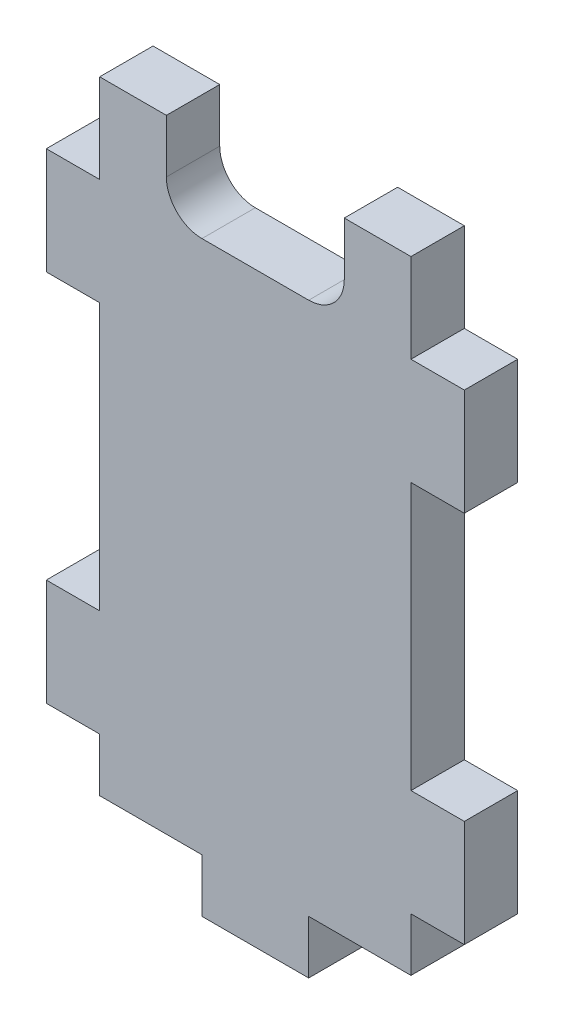
ISO-10303-21;
HEADER;
FILE_DESCRIPTION(('STEP AP214'),'2;1');
FILE_NAME('part.step','',(''),(''),'','','');
FILE_SCHEMA(('AUTOMOTIVE_DESIGN { 1 0 10303 214 1 1 1 1 }'));
ENDSEC;
DATA;
#1=APPLICATION_CONTEXT('core data for automotive mechanical design processes');
#2=APPLICATION_PROTOCOL_DEFINITION('international standard','automotive_design',2000,#1);
#3=PRODUCT_CONTEXT('',#1,'mechanical');
#4=PRODUCT('Part','Part','',(#3));
#5=PRODUCT_RELATED_PRODUCT_CATEGORY('part','',(#4));
#6=PRODUCT_DEFINITION_FORMATION('','',#4);
#7=PRODUCT_DEFINITION_CONTEXT('part definition',#1,'design');
#8=PRODUCT_DEFINITION('design','',#6,#7);
#9=PRODUCT_DEFINITION_SHAPE('','',#8);
#10=(LENGTH_UNIT() NAMED_UNIT(*) SI_UNIT(.MILLI.,.METRE.));
#11=(NAMED_UNIT(*) PLANE_ANGLE_UNIT() SI_UNIT($,.RADIAN.));
#12=(NAMED_UNIT(*) SI_UNIT($,.STERADIAN.) SOLID_ANGLE_UNIT());
#13=UNCERTAINTY_MEASURE_WITH_UNIT(LENGTH_MEASURE(1.E-05),#10,'distance_accuracy_value','');
#14=(GEOMETRIC_REPRESENTATION_CONTEXT(3) GLOBAL_UNCERTAINTY_ASSIGNED_CONTEXT((#13)) GLOBAL_UNIT_ASSIGNED_CONTEXT((#10,
#11,#12)) REPRESENTATION_CONTEXT('',''));
#15=CARTESIAN_POINT('',(0.,0.,0.));
#16=DIRECTION('',(0.,0.,1.));
#17=DIRECTION('',(1.,0.,0.));
#18=AXIS2_PLACEMENT_3D('',#15,#16,#17);
#19=CARTESIAN_POINT('',(-17.5,0.,-6.));
#20=DIRECTION('',(1.,0.,0.));
#21=DIRECTION('',(0.,0.,-1.));
#22=AXIS2_PLACEMENT_3D('',#19,#20,#21);
#23=PLANE('',#22);
#24=DIRECTION('',(0.,0.,1.));
#25=VECTOR('',#24,1.);
#26=CARTESIAN_POINT('',(-17.5,-29.,-19.4164078649987));
#27=LINE('',#26,#25);
#28=CARTESIAN_POINT('',(-17.5,-29.,-6.));
#29=VERTEX_POINT('',#28);
#30=CARTESIAN_POINT('',(-17.5,-29.,0.));
#31=VERTEX_POINT('',#30);
#32=EDGE_CURVE('E249',#29,#31,#27,.T.);
#33=ORIENTED_EDGE('',*,*,#32,.F.);
#34=DIRECTION('',(0.,1.,0.));
#35=VECTOR('',#34,1.);
#36=CARTESIAN_POINT('',(-17.5,0.,-6.));
#37=LINE('',#36,#35);
#38=CARTESIAN_POINT('',(-17.5,-35.,-6.));
#39=VERTEX_POINT('',#38);
#40=EDGE_CURVE('E381',#39,#29,#37,.T.);
#41=ORIENTED_EDGE('',*,*,#40,.F.);
#42=DIRECTION('',(0.,0.,1.));
#43=VECTOR('',#42,1.);
#44=CARTESIAN_POINT('',(-17.5,-35.,-6.));
#45=LINE('',#44,#43);
#46=CARTESIAN_POINT('',(-17.5,-35.,0.));
#47=VERTEX_POINT('',#46);
#48=EDGE_CURVE('E426',#39,#47,#45,.T.);
#49=ORIENTED_EDGE('',*,*,#48,.T.);
#50=DIRECTION('',(0.,1.,0.));
#51=VECTOR('',#50,1.);
#52=CARTESIAN_POINT('',(-17.5,0.,0.));
#53=LINE('',#52,#51);
#54=EDGE_CURVE('E414',#47,#31,#53,.T.);
#55=ORIENTED_EDGE('',*,*,#54,.T.);
#56=EDGE_LOOP('',(#33,#41,#49,#55));
#57=FACE_BOUND('',#56,.T.);
#58=ADVANCED_FACE('F41',(#57),#23,.F.);
#59=CARTESIAN_POINT('',(-17.5,-17.,-6.));
#60=VERTEX_POINT('',#59);
#61=CARTESIAN_POINT('',(-17.5,13.,-6.));
#62=VERTEX_POINT('',#61);
#63=EDGE_CURVE('E384',#60,#62,#37,.T.);
#64=ORIENTED_EDGE('',*,*,#63,.F.);
#65=DIRECTION('',(0.,0.,1.));
#66=VECTOR('',#65,1.);
#67=CARTESIAN_POINT('',(-17.5,-17.,-19.4164078649987));
#68=LINE('',#67,#66);
#69=CARTESIAN_POINT('',(-17.5,-17.,0.));
#70=VERTEX_POINT('',#69);
#71=EDGE_CURVE('E270',#60,#70,#68,.T.);
#72=ORIENTED_EDGE('',*,*,#71,.T.);
#73=CARTESIAN_POINT('',(-17.5,13.,0.));
#74=VERTEX_POINT('',#73);
#75=EDGE_CURVE('E416',#70,#74,#53,.T.);
#76=ORIENTED_EDGE('',*,*,#75,.T.);
#77=DIRECTION('',(0.,0.,1.));
#78=VECTOR('',#77,1.);
#79=CARTESIAN_POINT('',(-17.5,13.,-19.4164078649987));
#80=LINE('',#79,#78);
#81=EDGE_CURVE('E297',#62,#74,#80,.T.);
#82=ORIENTED_EDGE('',*,*,#81,.F.);
#83=EDGE_LOOP('',(#64,#72,#76,#82));
#84=FACE_BOUND('',#83,.T.);
#85=ADVANCED_FACE('F507',(#84),#23,.F.);
#86=CARTESIAN_POINT('',(17.5,0.,-6.));
#87=DIRECTION('',(1.,0.,0.));
#88=DIRECTION('',(0.,1.,0.));
#89=AXIS2_PLACEMENT_3D('',#86,#87,#88);
#90=PLANE('',#89);
#91=DIRECTION('',(0.,1.,0.));
#92=VECTOR('',#91,1.);
#93=CARTESIAN_POINT('',(17.5,0.,0.));
#94=LINE('',#93,#92);
#95=CARTESIAN_POINT('',(17.5,-17.,0.));
#96=VERTEX_POINT('',#95);
#97=CARTESIAN_POINT('',(17.5,13.,0.));
#98=VERTEX_POINT('',#97);
#99=EDGE_CURVE('E402',#96,#98,#94,.T.);
#100=ORIENTED_EDGE('',*,*,#99,.F.);
#101=DIRECTION('',(0.,0.,1.));
#102=VECTOR('',#101,1.);
#103=CARTESIAN_POINT('',(17.5,-17.,-19.4164078649987));
#104=LINE('',#103,#102);
#105=CARTESIAN_POINT('',(17.5,-17.,-6.));
#106=VERTEX_POINT('',#105);
#107=EDGE_CURVE('E324',#106,#96,#104,.T.);
#108=ORIENTED_EDGE('',*,*,#107,.F.);
#109=DIRECTION('',(0.,1.,0.));
#110=VECTOR('',#109,1.);
#111=CARTESIAN_POINT('',(17.5,0.,-6.));
#112=LINE('',#111,#110);
#113=CARTESIAN_POINT('',(17.5,13.,-6.));
#114=VERTEX_POINT('',#113);
#115=EDGE_CURVE('E370',#106,#114,#112,.T.);
#116=ORIENTED_EDGE('',*,*,#115,.T.);
#117=DIRECTION('',(0.,0.,1.));
#118=VECTOR('',#117,1.);
#119=CARTESIAN_POINT('',(17.5,13.,-19.4164078649987));
#120=LINE('',#119,#118);
#121=EDGE_CURVE('E348',#114,#98,#120,.T.);
#122=ORIENTED_EDGE('',*,*,#121,.T.);
#123=EDGE_LOOP('',(#100,#108,#116,#122));
#124=FACE_BOUND('',#123,.T.);
#125=ADVANCED_FACE('F478',(#124),#90,.T.);
#126=DIRECTION('',(0.,0.,1.));
#127=VECTOR('',#126,1.);
#128=CARTESIAN_POINT('',(17.5,-29.,-19.4164078649987));
#129=LINE('',#128,#127);
#130=CARTESIAN_POINT('',(17.5,-29.,-6.));
#131=VERTEX_POINT('',#130);
#132=CARTESIAN_POINT('',(17.5,-29.,0.));
#133=VERTEX_POINT('',#132);
#134=EDGE_CURVE('E321',#131,#133,#129,.T.);
#135=ORIENTED_EDGE('',*,*,#134,.T.);
#136=CARTESIAN_POINT('',(17.5,-35.,0.));
#137=VERTEX_POINT('',#136);
#138=EDGE_CURVE('E398',#137,#133,#94,.T.);
#139=ORIENTED_EDGE('',*,*,#138,.F.);
#140=DIRECTION('',(0.,0.,1.));
#141=VECTOR('',#140,1.);
#142=CARTESIAN_POINT('',(17.5,-35.,-6.));
#143=LINE('',#142,#141);
#144=CARTESIAN_POINT('',(17.5,-35.,-6.));
#145=VERTEX_POINT('',#144);
#146=EDGE_CURVE('E439',#145,#137,#143,.T.);
#147=ORIENTED_EDGE('',*,*,#146,.F.);
#148=EDGE_CURVE('E366',#145,#131,#112,.T.);
#149=ORIENTED_EDGE('',*,*,#148,.T.);
#150=EDGE_LOOP('',(#135,#139,#147,#149));
#151=FACE_BOUND('',#150,.T.);
#152=ADVANCED_FACE('F564',(#151),#90,.T.);
#153=CARTESIAN_POINT('',(0.,-41.,-6.));
#154=DIRECTION('',(0.,1.,0.));
#155=DIRECTION('',(0.,0.,1.));
#156=AXIS2_PLACEMENT_3D('',#153,#154,#155);
#157=PLANE('',#156);
#158=DIRECTION('',(-1.,0.,0.));
#159=VECTOR('',#158,1.);
#160=CARTESIAN_POINT('',(0.,-41.,0.));
#161=LINE('',#160,#159);
#162=CARTESIAN_POINT('',(6.00000000000002,-41.,0.));
#163=VERTEX_POINT('',#162);
#164=CARTESIAN_POINT('',(-5.99999999999999,-41.,0.));
#165=VERTEX_POINT('',#164);
#166=EDGE_CURVE('E336',#163,#165,#161,.T.);
#167=ORIENTED_EDGE('',*,*,#166,.T.);
#168=DIRECTION('',(0.,0.,1.));
#169=VECTOR('',#168,1.);
#170=CARTESIAN_POINT('',(-5.99999999999999,-41.,-6.));
#171=LINE('',#170,#169);
#172=CARTESIAN_POINT('',(-5.99999999999999,-41.,-6.));
#173=VERTEX_POINT('',#172);
#174=EDGE_CURVE('E420',#173,#165,#171,.T.);
#175=ORIENTED_EDGE('',*,*,#174,.F.);
#176=DIRECTION('',(-1.,0.,0.));
#177=VECTOR('',#176,1.);
#178=CARTESIAN_POINT('',(0.,-41.,-6.));
#179=LINE('',#178,#177);
#180=CARTESIAN_POINT('',(6.00000000000002,-41.,-6.));
#181=VERTEX_POINT('',#180);
#182=EDGE_CURVE('E355',#181,#173,#179,.T.);
#183=ORIENTED_EDGE('',*,*,#182,.F.);
#184=DIRECTION('',(0.,0.,1.));
#185=VECTOR('',#184,1.);
#186=CARTESIAN_POINT('',(6.00000000000002,-41.,-6.));
#187=LINE('',#186,#185);
#188=EDGE_CURVE('E388',#181,#163,#187,.T.);
#189=ORIENTED_EDGE('',*,*,#188,.T.);
#190=EDGE_LOOP('',(#167,#175,#183,#189));
#191=FACE_BOUND('',#190,.T.);
#192=ADVANCED_FACE('F569',(#191),#157,.F.);
#193=CARTESIAN_POINT('',(-5.99999999999998,0.,-6.));
#194=DIRECTION('',(1.,0.,0.));
#195=DIRECTION('',(0.,1.,0.));
#196=AXIS2_PLACEMENT_3D('',#193,#194,#195);
#197=PLANE('',#196);
#198=DIRECTION('',(0.,1.,0.));
#199=VECTOR('',#198,1.);
#200=CARTESIAN_POINT('',(-5.99999999999998,0.,0.));
#201=LINE('',#200,#199);
#202=CARTESIAN_POINT('',(-5.99999999999999,-35.,0.));
#203=VERTEX_POINT('',#202);
#204=EDGE_CURVE('E359',#165,#203,#201,.T.);
#205=ORIENTED_EDGE('',*,*,#204,.T.);
#206=DIRECTION('',(0.,0.,1.));
#207=VECTOR('',#206,1.);
#208=CARTESIAN_POINT('',(-5.99999999999999,-35.,-6.));
#209=LINE('',#208,#207);
#210=CARTESIAN_POINT('',(-5.99999999999999,-35.,-6.));
#211=VERTEX_POINT('',#210);
#212=EDGE_CURVE('E424',#211,#203,#209,.T.);
#213=ORIENTED_EDGE('',*,*,#212,.F.);
#214=DIRECTION('',(0.,1.,0.));
#215=VECTOR('',#214,1.);
#216=CARTESIAN_POINT('',(-5.99999999999998,0.,-6.));
#217=LINE('',#216,#215);
#218=EDGE_CURVE('E386',#173,#211,#217,.T.);
#219=ORIENTED_EDGE('',*,*,#218,.F.);
#220=ORIENTED_EDGE('',*,*,#174,.T.);
#221=EDGE_LOOP('',(#205,#213,#219,#220));
#222=FACE_BOUND('',#221,.T.);
#223=ADVANCED_FACE('F527',(#222),#197,.F.);
#224=CARTESIAN_POINT('',(0.,-35.,-6.));
#225=DIRECTION('',(0.,-1.,0.));
#226=DIRECTION('',(1.,0.,0.));
#227=AXIS2_PLACEMENT_3D('',#224,#225,#226);
#228=PLANE('',#227);
#229=DIRECTION('',(1.,0.,0.));
#230=VECTOR('',#229,1.);
#231=CARTESIAN_POINT('',(0.,-35.,0.));
#232=LINE('',#231,#230);
#233=EDGE_CURVE('E397',#47,#203,#232,.T.);
#234=ORIENTED_EDGE('',*,*,#233,.F.);
#235=ORIENTED_EDGE('',*,*,#48,.F.);
#236=DIRECTION('',(1.,0.,0.));
#237=VECTOR('',#236,1.);
#238=CARTESIAN_POINT('',(0.,-35.,-6.));
#239=LINE('',#238,#237);
#240=EDGE_CURVE('E365',#39,#211,#239,.T.);
#241=ORIENTED_EDGE('',*,*,#240,.T.);
#242=ORIENTED_EDGE('',*,*,#212,.T.);
#243=EDGE_LOOP('',(#234,#235,#241,#242));
#244=FACE_BOUND('',#243,.T.);
#245=ADVANCED_FACE('F519',(#244),#228,.T.);
#246=CARTESIAN_POINT('',(-17.5,25.,-6.));
#247=VERTEX_POINT('',#246);
#248=CARTESIAN_POINT('',(-17.5,35.,-6.));
#249=VERTEX_POINT('',#248);
#250=EDGE_CURVE('E385',#247,#249,#37,.T.);
#251=ORIENTED_EDGE('',*,*,#250,.F.);
#252=DIRECTION('',(0.,0.,1.));
#253=VECTOR('',#252,1.);
#254=CARTESIAN_POINT('',(-17.5,25.,-19.4164078649987));
#255=LINE('',#254,#253);
#256=CARTESIAN_POINT('',(-17.5,25.,0.));
#257=VERTEX_POINT('',#256);
#258=EDGE_CURVE('E295',#247,#257,#255,.T.);
#259=ORIENTED_EDGE('',*,*,#258,.T.);
#260=CARTESIAN_POINT('',(-17.5,35.,0.));
#261=VERTEX_POINT('',#260);
#262=EDGE_CURVE('E417',#257,#261,#53,.T.);
#263=ORIENTED_EDGE('',*,*,#262,.T.);
#264=DIRECTION('',(0.,0.,1.));
#265=VECTOR('',#264,1.);
#266=CARTESIAN_POINT('',(-17.5,35.,-6.));
#267=LINE('',#266,#265);
#268=EDGE_CURVE('E428',#249,#261,#267,.T.);
#269=ORIENTED_EDGE('',*,*,#268,.F.);
#270=EDGE_LOOP('',(#251,#259,#263,#269));
#271=FACE_BOUND('',#270,.T.);
#272=ADVANCED_FACE('F510',(#271),#23,.F.);
#273=CARTESIAN_POINT('',(0.,35.,-6.));
#274=DIRECTION('',(0.,-1.,0.));
#275=DIRECTION('',(0.,0.,-1.));
#276=AXIS2_PLACEMENT_3D('',#273,#274,#275);
#277=PLANE('',#276);
#278=DIRECTION('',(1.,0.,0.));
#279=VECTOR('',#278,1.);
#280=CARTESIAN_POINT('',(0.,35.,0.));
#281=LINE('',#280,#279);
#282=CARTESIAN_POINT('',(-10.,35.,0.));
#283=VERTEX_POINT('',#282);
#284=EDGE_CURVE('E406',#261,#283,#281,.T.);
#285=ORIENTED_EDGE('',*,*,#284,.T.);
#286=DIRECTION('',(0.,0.,1.));
#287=VECTOR('',#286,1.);
#288=CARTESIAN_POINT('',(-10.,35.,-6.));
#289=LINE('',#288,#287);
#290=CARTESIAN_POINT('',(-10.,35.,-6.));
#291=VERTEX_POINT('',#290);
#292=EDGE_CURVE('E431',#291,#283,#289,.T.);
#293=ORIENTED_EDGE('',*,*,#292,.F.);
#294=DIRECTION('',(1.,0.,0.));
#295=VECTOR('',#294,1.);
#296=CARTESIAN_POINT('',(0.,35.,-6.));
#297=LINE('',#296,#295);
#298=EDGE_CURVE('E374',#249,#291,#297,.T.);
#299=ORIENTED_EDGE('',*,*,#298,.F.);
#300=ORIENTED_EDGE('',*,*,#268,.T.);
#301=EDGE_LOOP('',(#285,#293,#299,#300));
#302=FACE_BOUND('',#301,.T.);
#303=ADVANCED_FACE('F518',(#302),#277,.F.);
#304=CARTESIAN_POINT('',(-10.,0.,-6.));
#305=DIRECTION('',(1.,0.,0.));
#306=DIRECTION('',(0.,0.,-1.));
#307=AXIS2_PLACEMENT_3D('',#304,#305,#306);
#308=PLANE('',#307);
#309=DIRECTION('',(0.,1.,0.));
#310=VECTOR('',#309,1.);
#311=CARTESIAN_POINT('',(-10.,0.,0.));
#312=LINE('',#311,#310);
#313=CARTESIAN_POINT('',(-10.,29.,0.));
#314=VERTEX_POINT('',#313);
#315=EDGE_CURVE('E412',#314,#283,#312,.T.);
#316=ORIENTED_EDGE('',*,*,#315,.F.);
#317=DIRECTION('',(0.,0.,1.));
#318=VECTOR('',#317,1.);
#319=CARTESIAN_POINT('',(-10.,29.,-6.));
#320=LINE('',#319,#318);
#321=CARTESIAN_POINT('',(-10.,29.,-6.));
#322=VERTEX_POINT('',#321);
#323=EDGE_CURVE('E449',#314,#322,#320,.F.);
#324=ORIENTED_EDGE('',*,*,#323,.T.);
#325=DIRECTION('',(0.,1.,0.));
#326=VECTOR('',#325,1.);
#327=CARTESIAN_POINT('',(-10.,0.,-6.));
#328=LINE('',#327,#326);
#329=EDGE_CURVE('E379',#322,#291,#328,.T.);
#330=ORIENTED_EDGE('',*,*,#329,.T.);
#331=ORIENTED_EDGE('',*,*,#292,.T.);
#332=EDGE_LOOP('',(#316,#324,#330,#331));
#333=FACE_BOUND('',#332,.T.);
#334=ADVANCED_FACE('F525',(#333),#308,.T.);
#335=CARTESIAN_POINT('',(0.,25.,-6.));
#336=DIRECTION('',(0.,1.,0.));
#337=DIRECTION('',(0.,0.,1.));
#338=AXIS2_PLACEMENT_3D('',#335,#336,#337);
#339=PLANE('',#338);
#340=DIRECTION('',(-1.,0.,0.));
#341=VECTOR('',#340,1.);
#342=CARTESIAN_POINT('',(0.,25.,-6.));
#343=LINE('',#342,#341);
#344=CARTESIAN_POINT('',(6.00000000000001,25.,-6.));
#345=VERTEX_POINT('',#344);
#346=CARTESIAN_POINT('',(-6.00000000000001,25.,-6.));
#347=VERTEX_POINT('',#346);
#348=EDGE_CURVE('E376',#345,#347,#343,.T.);
#349=ORIENTED_EDGE('',*,*,#348,.T.);
#350=DIRECTION('',(0.,0.,1.));
#351=VECTOR('',#350,1.);
#352=CARTESIAN_POINT('',(-6.00000000000001,25.,0.));
#353=LINE('',#352,#351);
#354=CARTESIAN_POINT('',(-6.00000000000001,25.,0.));
#355=VERTEX_POINT('',#354);
#356=EDGE_CURVE('E446',#347,#355,#353,.T.);
#357=ORIENTED_EDGE('',*,*,#356,.T.);
#358=DIRECTION('',(-1.,0.,0.));
#359=VECTOR('',#358,1.);
#360=CARTESIAN_POINT('',(0.,25.,0.));
#361=LINE('',#360,#359);
#362=CARTESIAN_POINT('',(6.00000000000001,25.,0.));
#363=VERTEX_POINT('',#362);
#364=EDGE_CURVE('E409',#363,#355,#361,.T.);
#365=ORIENTED_EDGE('',*,*,#364,.F.);
#366=DIRECTION('',(0.,0.,1.));
#367=VECTOR('',#366,1.);
#368=CARTESIAN_POINT('',(6.00000000000001,25.,-6.));
#369=LINE('',#368,#367);
#370=EDGE_CURVE('E423',#363,#345,#369,.F.);
#371=ORIENTED_EDGE('',*,*,#370,.T.);
#372=EDGE_LOOP('',(#349,#357,#365,#371));
#373=FACE_BOUND('',#372,.T.);
#374=ADVANCED_FACE('F460',(#373),#339,.T.);
#375=CARTESIAN_POINT('',(10.,0.,-6.));
#376=DIRECTION('',(-1.,0.,0.));
#377=DIRECTION('',(0.,0.,1.));
#378=AXIS2_PLACEMENT_3D('',#375,#376,#377);
#379=PLANE('',#378);
#380=DIRECTION('',(0.,-1.,0.));
#381=VECTOR('',#380,1.);
#382=CARTESIAN_POINT('',(10.,0.,-6.));
#383=LINE('',#382,#381);
#384=CARTESIAN_POINT('',(10.,35.,-6.));
#385=VERTEX_POINT('',#384);
#386=CARTESIAN_POINT('',(10.,29.,-6.));
#387=VERTEX_POINT('',#386);
#388=EDGE_CURVE('E373',#385,#387,#383,.T.);
#389=ORIENTED_EDGE('',*,*,#388,.T.);
#390=DIRECTION('',(0.,0.,1.));
#391=VECTOR('',#390,1.);
#392=CARTESIAN_POINT('',(10.,29.,0.));
#393=LINE('',#392,#391);
#394=CARTESIAN_POINT('',(10.,29.,0.));
#395=VERTEX_POINT('',#394);
#396=EDGE_CURVE('E451',#387,#395,#393,.T.);
#397=ORIENTED_EDGE('',*,*,#396,.T.);
#398=DIRECTION('',(0.,-1.,0.));
#399=VECTOR('',#398,1.);
#400=CARTESIAN_POINT('',(10.,0.,0.));
#401=LINE('',#400,#399);
#402=CARTESIAN_POINT('',(10.,35.,0.));
#403=VERTEX_POINT('',#402);
#404=EDGE_CURVE('E405',#403,#395,#401,.T.);
#405=ORIENTED_EDGE('',*,*,#404,.F.);
#406=DIRECTION('',(0.,0.,1.));
#407=VECTOR('',#406,1.);
#408=CARTESIAN_POINT('',(10.,35.,-6.));
#409=LINE('',#408,#407);
#410=EDGE_CURVE('E434',#385,#403,#409,.T.);
#411=ORIENTED_EDGE('',*,*,#410,.F.);
#412=EDGE_LOOP('',(#389,#397,#405,#411));
#413=FACE_BOUND('',#412,.T.);
#414=ADVANCED_FACE('F463',(#413),#379,.T.);
#415=CARTESIAN_POINT('',(17.5,35.,0.));
#416=VERTEX_POINT('',#415);
#417=EDGE_CURVE('E401',#403,#416,#281,.T.);
#418=ORIENTED_EDGE('',*,*,#417,.T.);
#419=DIRECTION('',(0.,0.,1.));
#420=VECTOR('',#419,1.);
#421=CARTESIAN_POINT('',(17.5,35.,-6.));
#422=LINE('',#421,#420);
#423=CARTESIAN_POINT('',(17.5,35.,-6.));
#424=VERTEX_POINT('',#423);
#425=EDGE_CURVE('E436',#424,#416,#422,.T.);
#426=ORIENTED_EDGE('',*,*,#425,.F.);
#427=EDGE_CURVE('E369',#385,#424,#297,.T.);
#428=ORIENTED_EDGE('',*,*,#427,.F.);
#429=ORIENTED_EDGE('',*,*,#410,.T.);
#430=EDGE_LOOP('',(#418,#426,#428,#429));
#431=FACE_BOUND('',#430,.T.);
#432=ADVANCED_FACE('F469',(#431),#277,.F.);
#433=DIRECTION('',(0.,0.,1.));
#434=VECTOR('',#433,1.);
#435=CARTESIAN_POINT('',(17.5,25.,-19.4164078649987));
#436=LINE('',#435,#434);
#437=CARTESIAN_POINT('',(17.5,25.,-6.));
#438=VERTEX_POINT('',#437);
#439=CARTESIAN_POINT('',(17.5,25.,0.));
#440=VERTEX_POINT('',#439);
#441=EDGE_CURVE('E351',#438,#440,#436,.T.);
#442=ORIENTED_EDGE('',*,*,#441,.F.);
#443=EDGE_CURVE('E364',#438,#424,#112,.T.);
#444=ORIENTED_EDGE('',*,*,#443,.T.);
#445=ORIENTED_EDGE('',*,*,#425,.T.);
#446=EDGE_CURVE('E396',#440,#416,#94,.T.);
#447=ORIENTED_EDGE('',*,*,#446,.F.);
#448=EDGE_LOOP('',(#442,#444,#445,#447));
#449=FACE_BOUND('',#448,.T.);
#450=ADVANCED_FACE('F473',(#449),#90,.T.);
#451=CARTESIAN_POINT('',(6.00000000000001,-35.,0.));
#452=VERTEX_POINT('',#451);
#453=EDGE_CURVE('E393',#452,#137,#232,.T.);
#454=ORIENTED_EDGE('',*,*,#453,.F.);
#455=DIRECTION('',(0.,0.,1.));
#456=VECTOR('',#455,1.);
#457=CARTESIAN_POINT('',(6.00000000000001,-35.,-6.));
#458=LINE('',#457,#456);
#459=CARTESIAN_POINT('',(6.00000000000001,-35.,-6.));
#460=VERTEX_POINT('',#459);
#461=EDGE_CURVE('E441',#460,#452,#458,.T.);
#462=ORIENTED_EDGE('',*,*,#461,.F.);
#463=EDGE_CURVE('E361',#460,#145,#239,.T.);
#464=ORIENTED_EDGE('',*,*,#463,.T.);
#465=ORIENTED_EDGE('',*,*,#146,.T.);
#466=EDGE_LOOP('',(#454,#462,#464,#465));
#467=FACE_BOUND('',#466,.T.);
#468=ADVANCED_FACE('F529',(#467),#228,.T.);
#469=CARTESIAN_POINT('',(6.00000000000001,0.,-6.));
#470=DIRECTION('',(-1.,0.,0.));
#471=DIRECTION('',(0.,-1.,0.));
#472=AXIS2_PLACEMENT_3D('',#469,#470,#471);
#473=PLANE('',#472);
#474=DIRECTION('',(0.,-1.,0.));
#475=VECTOR('',#474,1.);
#476=CARTESIAN_POINT('',(6.00000000000001,0.,0.));
#477=LINE('',#476,#475);
#478=EDGE_CURVE('E391',#452,#163,#477,.T.);
#479=ORIENTED_EDGE('',*,*,#478,.T.);
#480=ORIENTED_EDGE('',*,*,#188,.F.);
#481=DIRECTION('',(0.,-1.,0.));
#482=VECTOR('',#481,1.);
#483=CARTESIAN_POINT('',(6.00000000000001,0.,-6.));
#484=LINE('',#483,#482);
#485=EDGE_CURVE('E358',#460,#181,#484,.T.);
#486=ORIENTED_EDGE('',*,*,#485,.F.);
#487=ORIENTED_EDGE('',*,*,#461,.T.);
#488=EDGE_LOOP('',(#479,#480,#486,#487));
#489=FACE_BOUND('',#488,.T.);
#490=ADVANCED_FACE('F565',(#489),#473,.F.);
#491=CARTESIAN_POINT('',(0.,0.,-6.));
#492=DIRECTION('',(0.,0.,1.));
#493=DIRECTION('',(1.,0.,0.));
#494=AXIS2_PLACEMENT_3D('',#491,#492,#493);
#495=PLANE('',#494);
#496=ORIENTED_EDGE('',*,*,#182,.T.);
#497=ORIENTED_EDGE('',*,*,#218,.T.);
#498=ORIENTED_EDGE('',*,*,#240,.F.);
#499=ORIENTED_EDGE('',*,*,#40,.T.);
#500=DIRECTION('',(1.,0.,0.));
#501=VECTOR('',#500,1.);
#502=CARTESIAN_POINT('',(0.,-29.,-6.));
#503=LINE('',#502,#501);
#504=CARTESIAN_POINT('',(-23.5,-29.,-6.));
#505=VERTEX_POINT('',#504);
#506=EDGE_CURVE('E269',#505,#29,#503,.T.);
#507=ORIENTED_EDGE('',*,*,#506,.F.);
#508=DIRECTION('',(0.,1.,0.));
#509=VECTOR('',#508,1.);
#510=CARTESIAN_POINT('',(-23.5,0.,-6.));
#511=LINE('',#510,#509);
#512=CARTESIAN_POINT('',(-23.5,-17.,-6.));
#513=VERTEX_POINT('',#512);
#514=EDGE_CURVE('E246',#505,#513,#511,.T.);
#515=ORIENTED_EDGE('',*,*,#514,.T.);
#516=DIRECTION('',(1.,0.,0.));
#517=VECTOR('',#516,1.);
#518=CARTESIAN_POINT('',(0.,-17.,-6.));
#519=LINE('',#518,#517);
#520=EDGE_CURVE('E275',#513,#60,#519,.T.);
#521=ORIENTED_EDGE('',*,*,#520,.T.);
#522=ORIENTED_EDGE('',*,*,#63,.T.);
#523=DIRECTION('',(1.,0.,0.));
#524=VECTOR('',#523,1.);
#525=CARTESIAN_POINT('',(0.,13.,-6.));
#526=LINE('',#525,#524);
#527=CARTESIAN_POINT('',(-23.5,13.,-6.));
#528=VERTEX_POINT('',#527);
#529=EDGE_CURVE('E280',#528,#62,#526,.T.);
#530=ORIENTED_EDGE('',*,*,#529,.F.);
#531=DIRECTION('',(0.,1.,0.));
#532=VECTOR('',#531,1.);
#533=CARTESIAN_POINT('',(-23.5,0.,-6.));
#534=LINE('',#533,#532);
#535=CARTESIAN_POINT('',(-23.5,25.,-6.));
#536=VERTEX_POINT('',#535);
#537=EDGE_CURVE('E279',#528,#536,#534,.T.);
#538=ORIENTED_EDGE('',*,*,#537,.T.);
#539=DIRECTION('',(1.,0.,0.));
#540=VECTOR('',#539,1.);
#541=CARTESIAN_POINT('',(0.,25.,-6.));
#542=LINE('',#541,#540);
#543=EDGE_CURVE('E276',#536,#247,#542,.T.);
#544=ORIENTED_EDGE('',*,*,#543,.T.);
#545=ORIENTED_EDGE('',*,*,#250,.T.);
#546=ORIENTED_EDGE('',*,*,#298,.T.);
#547=ORIENTED_EDGE('',*,*,#329,.F.);
#548=CARTESIAN_POINT('',(-6.00000000000001,29.,-6.));
#549=DIRECTION('',(0.,0.,1.));
#550=DIRECTION('',(1.,0.,0.));
#551=AXIS2_PLACEMENT_3D('',#548,#549,#550);
#552=CIRCLE('',#551,4.);
#553=EDGE_CURVE('E455',#322,#347,#552,.T.);
#554=ORIENTED_EDGE('',*,*,#553,.T.);
#555=ORIENTED_EDGE('',*,*,#348,.F.);
#556=CARTESIAN_POINT('',(6.00000000000001,29.,-6.));
#557=DIRECTION('',(0.,0.,1.));
#558=DIRECTION('',(1.,0.,0.));
#559=AXIS2_PLACEMENT_3D('',#556,#557,#558);
#560=CIRCLE('',#559,4.);
#561=EDGE_CURVE('E11',#345,#387,#560,.T.);
#562=ORIENTED_EDGE('',*,*,#561,.T.);
#563=ORIENTED_EDGE('',*,*,#388,.F.);
#564=ORIENTED_EDGE('',*,*,#427,.T.);
#565=ORIENTED_EDGE('',*,*,#443,.F.);
#566=DIRECTION('',(-1.,0.,0.));
#567=VECTOR('',#566,1.);
#568=CARTESIAN_POINT('',(0.,25.,-6.));
#569=LINE('',#568,#567);
#570=CARTESIAN_POINT('',(23.5,25.,-6.));
#571=VERTEX_POINT('',#570);
#572=EDGE_CURVE('E333',#571,#438,#569,.T.);
#573=ORIENTED_EDGE('',*,*,#572,.F.);
#574=DIRECTION('',(0.,1.,0.));
#575=VECTOR('',#574,1.);
#576=CARTESIAN_POINT('',(23.5,0.,-6.));
#577=LINE('',#576,#575);
#578=CARTESIAN_POINT('',(23.5,13.,-6.));
#579=VERTEX_POINT('',#578);
#580=EDGE_CURVE('E332',#579,#571,#577,.T.);
#581=ORIENTED_EDGE('',*,*,#580,.F.);
#582=DIRECTION('',(-1.,0.,0.));
#583=VECTOR('',#582,1.);
#584=CARTESIAN_POINT('',(0.,13.,-6.));
#585=LINE('',#584,#583);
#586=EDGE_CURVE('E329',#579,#114,#585,.T.);
#587=ORIENTED_EDGE('',*,*,#586,.T.);
#588=ORIENTED_EDGE('',*,*,#115,.F.);
#589=DIRECTION('',(-1.,0.,0.));
#590=VECTOR('',#589,1.);
#591=CARTESIAN_POINT('',(0.,-17.,-6.));
#592=LINE('',#591,#590);
#593=CARTESIAN_POINT('',(23.5,-17.,-6.));
#594=VERTEX_POINT('',#593);
#595=EDGE_CURVE('E306',#594,#106,#592,.T.);
#596=ORIENTED_EDGE('',*,*,#595,.F.);
#597=DIRECTION('',(0.,1.,0.));
#598=VECTOR('',#597,1.);
#599=CARTESIAN_POINT('',(23.5,0.,-6.));
#600=LINE('',#599,#598);
#601=CARTESIAN_POINT('',(23.5,-29.,-6.));
#602=VERTEX_POINT('',#601);
#603=EDGE_CURVE('E305',#602,#594,#600,.T.);
#604=ORIENTED_EDGE('',*,*,#603,.F.);
#605=DIRECTION('',(-1.,0.,0.));
#606=VECTOR('',#605,1.);
#607=CARTESIAN_POINT('',(0.,-29.,-6.));
#608=LINE('',#607,#606);
#609=EDGE_CURVE('E303',#602,#131,#608,.T.);
#610=ORIENTED_EDGE('',*,*,#609,.T.);
#611=ORIENTED_EDGE('',*,*,#148,.F.);
#612=ORIENTED_EDGE('',*,*,#463,.F.);
#613=ORIENTED_EDGE('',*,*,#485,.T.);
#614=EDGE_LOOP('',(#496,#497,#498,#499,#507,#515,#521,#522,#530,#538,#544,#545,#546,#547,#554,
#555,#562,#563,#564,#565,#573,#581,#587,#588,#596,#604,#610,#611,#612,#613));
#615=FACE_BOUND('',#614,.T.);
#616=ADVANCED_FACE('F465',(#615),#495,.F.);
#617=CARTESIAN_POINT('',(0.,0.,0.));
#618=DIRECTION('',(0.,0.,1.));
#619=DIRECTION('',(1.,0.,0.));
#620=AXIS2_PLACEMENT_3D('',#617,#618,#619);
#621=PLANE('',#620);
#622=ORIENTED_EDGE('',*,*,#166,.F.);
#623=ORIENTED_EDGE('',*,*,#478,.F.);
#624=ORIENTED_EDGE('',*,*,#453,.T.);
#625=ORIENTED_EDGE('',*,*,#138,.T.);
#626=DIRECTION('',(1.,0.,0.));
#627=VECTOR('',#626,1.);
#628=CARTESIAN_POINT('',(0.,-29.,0.));
#629=LINE('',#628,#627);
#630=CARTESIAN_POINT('',(23.5,-29.,0.));
#631=VERTEX_POINT('',#630);
#632=EDGE_CURVE('E315',#133,#631,#629,.T.);
#633=ORIENTED_EDGE('',*,*,#632,.T.);
#634=DIRECTION('',(0.,-1.,0.));
#635=VECTOR('',#634,1.);
#636=CARTESIAN_POINT('',(23.5,0.,0.));
#637=LINE('',#636,#635);
#638=CARTESIAN_POINT('',(23.5,-17.,0.));
#639=VERTEX_POINT('',#638);
#640=EDGE_CURVE('E282',#639,#631,#637,.T.);
#641=ORIENTED_EDGE('',*,*,#640,.F.);
#642=DIRECTION('',(1.,0.,0.));
#643=VECTOR('',#642,1.);
#644=CARTESIAN_POINT('',(0.,-17.,0.));
#645=LINE('',#644,#643);
#646=EDGE_CURVE('E312',#96,#639,#645,.T.);
#647=ORIENTED_EDGE('',*,*,#646,.F.);
#648=ORIENTED_EDGE('',*,*,#99,.T.);
#649=DIRECTION('',(1.,0.,0.));
#650=VECTOR('',#649,1.);
#651=CARTESIAN_POINT('',(0.,13.,0.));
#652=LINE('',#651,#650);
#653=CARTESIAN_POINT('',(23.5,13.,0.));
#654=VERTEX_POINT('',#653);
#655=EDGE_CURVE('E342',#98,#654,#652,.T.);
#656=ORIENTED_EDGE('',*,*,#655,.T.);
#657=DIRECTION('',(0.,-1.,0.));
#658=VECTOR('',#657,1.);
#659=CARTESIAN_POINT('',(23.5,0.,0.));
#660=LINE('',#659,#658);
#661=CARTESIAN_POINT('',(23.5,25.,0.));
#662=VERTEX_POINT('',#661);
#663=EDGE_CURVE('E309',#662,#654,#660,.T.);
#664=ORIENTED_EDGE('',*,*,#663,.F.);
#665=DIRECTION('',(1.,0.,0.));
#666=VECTOR('',#665,1.);
#667=CARTESIAN_POINT('',(0.,25.,0.));
#668=LINE('',#667,#666);
#669=EDGE_CURVE('E339',#440,#662,#668,.T.);
#670=ORIENTED_EDGE('',*,*,#669,.F.);
#671=ORIENTED_EDGE('',*,*,#446,.T.);
#672=ORIENTED_EDGE('',*,*,#417,.F.);
#673=ORIENTED_EDGE('',*,*,#404,.T.);
#674=CARTESIAN_POINT('',(6.00000000000001,29.,0.));
#675=DIRECTION('',(0.,0.,1.));
#676=DIRECTION('',(1.,0.,0.));
#677=AXIS2_PLACEMENT_3D('',#674,#675,#676);
#678=CIRCLE('',#677,4.);
#679=EDGE_CURVE('E49',#395,#363,#678,.F.);
#680=ORIENTED_EDGE('',*,*,#679,.T.);
#681=ORIENTED_EDGE('',*,*,#364,.T.);
#682=CARTESIAN_POINT('',(-6.00000000000001,29.,0.));
#683=DIRECTION('',(0.,0.,1.));
#684=DIRECTION('',(1.,0.,0.));
#685=AXIS2_PLACEMENT_3D('',#682,#683,#684);
#686=CIRCLE('',#685,4.);
#687=EDGE_CURVE('E453',#355,#314,#686,.F.);
#688=ORIENTED_EDGE('',*,*,#687,.T.);
#689=ORIENTED_EDGE('',*,*,#315,.T.);
#690=ORIENTED_EDGE('',*,*,#284,.F.);
#691=ORIENTED_EDGE('',*,*,#262,.F.);
#692=DIRECTION('',(-1.,0.,0.));
#693=VECTOR('',#692,1.);
#694=CARTESIAN_POINT('',(0.,25.,0.));
#695=LINE('',#694,#693);
#696=CARTESIAN_POINT('',(-23.5,25.,0.));
#697=VERTEX_POINT('',#696);
#698=EDGE_CURVE('E289',#257,#697,#695,.T.);
#699=ORIENTED_EDGE('',*,*,#698,.T.);
#700=DIRECTION('',(0.,-1.,0.));
#701=VECTOR('',#700,1.);
#702=CARTESIAN_POINT('',(-23.5,0.,0.));
#703=LINE('',#702,#701);
#704=CARTESIAN_POINT('',(-23.5,13.,0.));
#705=VERTEX_POINT('',#704);
#706=EDGE_CURVE('E283',#697,#705,#703,.T.);
#707=ORIENTED_EDGE('',*,*,#706,.T.);
#708=DIRECTION('',(-1.,0.,0.));
#709=VECTOR('',#708,1.);
#710=CARTESIAN_POINT('',(0.,13.,0.));
#711=LINE('',#710,#709);
#712=EDGE_CURVE('E286',#74,#705,#711,.T.);
#713=ORIENTED_EDGE('',*,*,#712,.F.);
#714=ORIENTED_EDGE('',*,*,#75,.F.);
#715=DIRECTION('',(-1.,0.,0.));
#716=VECTOR('',#715,1.);
#717=CARTESIAN_POINT('',(0.,-17.,0.));
#718=LINE('',#717,#716);
#719=CARTESIAN_POINT('',(-23.5,-17.,0.));
#720=VERTEX_POINT('',#719);
#721=EDGE_CURVE('E250',#70,#720,#718,.T.);
#722=ORIENTED_EDGE('',*,*,#721,.T.);
#723=DIRECTION('',(0.,-1.,0.));
#724=VECTOR('',#723,1.);
#725=CARTESIAN_POINT('',(-23.5,0.,0.));
#726=LINE('',#725,#724);
#727=CARTESIAN_POINT('',(-23.5,-29.,0.));
#728=VERTEX_POINT('',#727);
#729=EDGE_CURVE('E244',#720,#728,#726,.T.);
#730=ORIENTED_EDGE('',*,*,#729,.T.);
#731=DIRECTION('',(-1.,0.,0.));
#732=VECTOR('',#731,1.);
#733=CARTESIAN_POINT('',(0.,-29.,0.));
#734=LINE('',#733,#732);
#735=EDGE_CURVE('E254',#31,#728,#734,.T.);
#736=ORIENTED_EDGE('',*,*,#735,.F.);
#737=ORIENTED_EDGE('',*,*,#54,.F.);
#738=ORIENTED_EDGE('',*,*,#233,.T.);
#739=ORIENTED_EDGE('',*,*,#204,.F.);
#740=EDGE_LOOP('',(#622,#623,#624,#625,#633,#641,#647,#648,#656,#664,#670,#671,#672,#673,#680,
#681,#688,#689,#690,#691,#699,#707,#713,#714,#722,#730,#736,#737,#738,#739));
#741=FACE_BOUND('',#740,.T.);
#742=ADVANCED_FACE('F260',(#741),#621,.T.);
#743=CARTESIAN_POINT('',(0.,25.,-19.4164078649987));
#744=DIRECTION('',(0.,-1.,0.));
#745=DIRECTION('',(0.,0.,-1.));
#746=AXIS2_PLACEMENT_3D('',#743,#744,#745);
#747=PLANE('',#746);
#748=DIRECTION('',(0.,0.,1.));
#749=VECTOR('',#748,1.);
#750=CARTESIAN_POINT('',(23.5,25.,-19.4164078649987));
#751=LINE('',#750,#749);
#752=EDGE_CURVE('E345',#571,#662,#751,.T.);
#753=ORIENTED_EDGE('',*,*,#752,.F.);
#754=ORIENTED_EDGE('',*,*,#572,.T.);
#755=ORIENTED_EDGE('',*,*,#441,.T.);
#756=ORIENTED_EDGE('',*,*,#669,.T.);
#757=EDGE_LOOP('',(#753,#754,#755,#756));
#758=FACE_BOUND('',#757,.T.);
#759=ADVANCED_FACE('F490',(#758),#747,.F.);
#760=CARTESIAN_POINT('',(0.,13.,-19.4164078649987));
#761=DIRECTION('',(0.,-1.,0.));
#762=DIRECTION('',(0.,0.,-1.));
#763=AXIS2_PLACEMENT_3D('',#760,#761,#762);
#764=PLANE('',#763);
#765=ORIENTED_EDGE('',*,*,#586,.F.);
#766=DIRECTION('',(0.,0.,1.));
#767=VECTOR('',#766,1.);
#768=CARTESIAN_POINT('',(23.5,13.,-19.4164078649987));
#769=LINE('',#768,#767);
#770=EDGE_CURVE('E346',#579,#654,#769,.T.);
#771=ORIENTED_EDGE('',*,*,#770,.T.);
#772=ORIENTED_EDGE('',*,*,#655,.F.);
#773=ORIENTED_EDGE('',*,*,#121,.F.);
#774=EDGE_LOOP('',(#765,#771,#772,#773));
#775=FACE_BOUND('',#774,.T.);
#776=ADVANCED_FACE('F484',(#775),#764,.T.);
#777=CARTESIAN_POINT('',(23.5,0.,-19.4164078649987));
#778=DIRECTION('',(-1.,0.,0.));
#779=DIRECTION('',(0.,-1.,0.));
#780=AXIS2_PLACEMENT_3D('',#777,#778,#779);
#781=PLANE('',#780);
#782=ORIENTED_EDGE('',*,*,#770,.F.);
#783=ORIENTED_EDGE('',*,*,#580,.T.);
#784=ORIENTED_EDGE('',*,*,#752,.T.);
#785=ORIENTED_EDGE('',*,*,#663,.T.);
#786=EDGE_LOOP('',(#782,#783,#784,#785));
#787=FACE_BOUND('',#786,.T.);
#788=ADVANCED_FACE('F492',(#787),#781,.F.);
#789=CARTESIAN_POINT('',(0.,-17.,-19.4164078649987));
#790=DIRECTION('',(0.,-1.,0.));
#791=DIRECTION('',(0.,0.,-1.));
#792=AXIS2_PLACEMENT_3D('',#789,#790,#791);
#793=PLANE('',#792);
#794=DIRECTION('',(0.,0.,1.));
#795=VECTOR('',#794,1.);
#796=CARTESIAN_POINT('',(23.5,-17.,-19.4164078649987));
#797=LINE('',#796,#795);
#798=EDGE_CURVE('E318',#594,#639,#797,.T.);
#799=ORIENTED_EDGE('',*,*,#798,.F.);
#800=ORIENTED_EDGE('',*,*,#595,.T.);
#801=ORIENTED_EDGE('',*,*,#107,.T.);
#802=ORIENTED_EDGE('',*,*,#646,.T.);
#803=EDGE_LOOP('',(#799,#800,#801,#802));
#804=FACE_BOUND('',#803,.T.);
#805=ADVANCED_FACE('F494',(#804),#793,.F.);
#806=CARTESIAN_POINT('',(0.,-29.,-19.4164078649987));
#807=DIRECTION('',(0.,-1.,0.));
#808=DIRECTION('',(0.,0.,-1.));
#809=AXIS2_PLACEMENT_3D('',#806,#807,#808);
#810=PLANE('',#809);
#811=ORIENTED_EDGE('',*,*,#609,.F.);
#812=DIRECTION('',(0.,0.,1.));
#813=VECTOR('',#812,1.);
#814=CARTESIAN_POINT('',(23.5,-29.,-19.4164078649987));
#815=LINE('',#814,#813);
#816=EDGE_CURVE('E319',#602,#631,#815,.T.);
#817=ORIENTED_EDGE('',*,*,#816,.T.);
#818=ORIENTED_EDGE('',*,*,#632,.F.);
#819=ORIENTED_EDGE('',*,*,#134,.F.);
#820=EDGE_LOOP('',(#811,#817,#818,#819));
#821=FACE_BOUND('',#820,.T.);
#822=ADVANCED_FACE('F500',(#821),#810,.T.);
#823=CARTESIAN_POINT('',(23.5,0.,-19.4164078649987));
#824=DIRECTION('',(-1.,0.,0.));
#825=DIRECTION('',(0.,-1.,0.));
#826=AXIS2_PLACEMENT_3D('',#823,#824,#825);
#827=PLANE('',#826);
#828=ORIENTED_EDGE('',*,*,#816,.F.);
#829=ORIENTED_EDGE('',*,*,#603,.T.);
#830=ORIENTED_EDGE('',*,*,#798,.T.);
#831=ORIENTED_EDGE('',*,*,#640,.T.);
#832=EDGE_LOOP('',(#828,#829,#830,#831));
#833=FACE_BOUND('',#832,.T.);
#834=ADVANCED_FACE('F592',(#833),#827,.F.);
#835=CARTESIAN_POINT('',(0.,13.,-19.4164078649987));
#836=DIRECTION('',(0.,1.,0.));
#837=DIRECTION('',(0.,0.,1.));
#838=AXIS2_PLACEMENT_3D('',#835,#836,#837);
#839=PLANE('',#838);
#840=DIRECTION('',(0.,0.,1.));
#841=VECTOR('',#840,1.);
#842=CARTESIAN_POINT('',(-23.5,13.,-19.4164078649987));
#843=LINE('',#842,#841);
#844=EDGE_CURVE('E292',#528,#705,#843,.T.);
#845=ORIENTED_EDGE('',*,*,#844,.F.);
#846=ORIENTED_EDGE('',*,*,#529,.T.);
#847=ORIENTED_EDGE('',*,*,#81,.T.);
#848=ORIENTED_EDGE('',*,*,#712,.T.);
#849=EDGE_LOOP('',(#845,#846,#847,#848));
#850=FACE_BOUND('',#849,.T.);
#851=ADVANCED_FACE('F589',(#850),#839,.F.);
#852=CARTESIAN_POINT('',(0.,25.,-19.4164078649987));
#853=DIRECTION('',(0.,1.,0.));
#854=DIRECTION('',(0.,0.,1.));
#855=AXIS2_PLACEMENT_3D('',#852,#853,#854);
#856=PLANE('',#855);
#857=ORIENTED_EDGE('',*,*,#543,.F.);
#858=DIRECTION('',(0.,0.,1.));
#859=VECTOR('',#858,1.);
#860=CARTESIAN_POINT('',(-23.5,25.,-19.4164078649987));
#861=LINE('',#860,#859);
#862=EDGE_CURVE('E293',#536,#697,#861,.T.);
#863=ORIENTED_EDGE('',*,*,#862,.T.);
#864=ORIENTED_EDGE('',*,*,#698,.F.);
#865=ORIENTED_EDGE('',*,*,#258,.F.);
#866=EDGE_LOOP('',(#857,#863,#864,#865));
#867=FACE_BOUND('',#866,.T.);
#868=ADVANCED_FACE('F540',(#867),#856,.T.);
#869=CARTESIAN_POINT('',(-23.5,0.,-19.4164078649987));
#870=DIRECTION('',(-1.,0.,0.));
#871=DIRECTION('',(0.,-1.,0.));
#872=AXIS2_PLACEMENT_3D('',#869,#870,#871);
#873=PLANE('',#872);
#874=ORIENTED_EDGE('',*,*,#537,.F.);
#875=ORIENTED_EDGE('',*,*,#844,.T.);
#876=ORIENTED_EDGE('',*,*,#706,.F.);
#877=ORIENTED_EDGE('',*,*,#862,.F.);
#878=EDGE_LOOP('',(#874,#875,#876,#877));
#879=FACE_BOUND('',#878,.T.);
#880=ADVANCED_FACE('F588',(#879),#873,.T.);
#881=CARTESIAN_POINT('',(0.,-29.,-19.4164078649987));
#882=DIRECTION('',(0.,1.,0.));
#883=DIRECTION('',(0.,0.,1.));
#884=AXIS2_PLACEMENT_3D('',#881,#882,#883);
#885=PLANE('',#884);
#886=DIRECTION('',(0.,0.,1.));
#887=VECTOR('',#886,1.);
#888=CARTESIAN_POINT('',(-23.5,-29.,-19.4164078649987));
#889=LINE('',#888,#887);
#890=EDGE_CURVE('E239',#505,#728,#889,.T.);
#891=ORIENTED_EDGE('',*,*,#890,.F.);
#892=ORIENTED_EDGE('',*,*,#506,.T.);
#893=ORIENTED_EDGE('',*,*,#32,.T.);
#894=ORIENTED_EDGE('',*,*,#735,.T.);
#895=EDGE_LOOP('',(#891,#892,#893,#894));
#896=FACE_BOUND('',#895,.T.);
#897=ADVANCED_FACE('F255',(#896),#885,.F.);
#898=CARTESIAN_POINT('',(0.,-17.,-19.4164078649987));
#899=DIRECTION('',(0.,1.,0.));
#900=DIRECTION('',(0.,0.,1.));
#901=AXIS2_PLACEMENT_3D('',#898,#899,#900);
#902=PLANE('',#901);
#903=ORIENTED_EDGE('',*,*,#520,.F.);
#904=DIRECTION('',(0.,0.,1.));
#905=VECTOR('',#904,1.);
#906=CARTESIAN_POINT('',(-23.5,-17.,-19.4164078649987));
#907=LINE('',#906,#905);
#908=EDGE_CURVE('E267',#513,#720,#907,.T.);
#909=ORIENTED_EDGE('',*,*,#908,.T.);
#910=ORIENTED_EDGE('',*,*,#721,.F.);
#911=ORIENTED_EDGE('',*,*,#71,.F.);
#912=EDGE_LOOP('',(#903,#909,#910,#911));
#913=FACE_BOUND('',#912,.T.);
#914=ADVANCED_FACE('F577',(#913),#902,.T.);
#915=CARTESIAN_POINT('',(-23.5,0.,-19.4164078649987));
#916=DIRECTION('',(-1.,0.,0.));
#917=DIRECTION('',(0.,-1.,0.));
#918=AXIS2_PLACEMENT_3D('',#915,#916,#917);
#919=PLANE('',#918);
#920=ORIENTED_EDGE('',*,*,#514,.F.);
#921=ORIENTED_EDGE('',*,*,#890,.T.);
#922=ORIENTED_EDGE('',*,*,#729,.F.);
#923=ORIENTED_EDGE('',*,*,#908,.F.);
#924=EDGE_LOOP('',(#920,#921,#922,#923));
#925=FACE_BOUND('',#924,.T.);
#926=ADVANCED_FACE('F241',(#925),#919,.T.);
#927=CARTESIAN_POINT('',(-6.00000000000001,29.,-6.));
#928=DIRECTION('',(0.,0.,-1.));
#929=DIRECTION('',(-1.,0.,0.));
#930=AXIS2_PLACEMENT_3D('',#927,#928,#929);
#931=CYLINDRICAL_SURFACE('',#930,4.);
#932=ORIENTED_EDGE('',*,*,#553,.F.);
#933=ORIENTED_EDGE('',*,*,#323,.F.);
#934=ORIENTED_EDGE('',*,*,#687,.F.);
#935=ORIENTED_EDGE('',*,*,#356,.F.);
#936=EDGE_LOOP('',(#932,#933,#934,#935));
#937=FACE_BOUND('',#936,.T.);
#938=ADVANCED_FACE('F551',(#937),#931,.F.);
#939=CARTESIAN_POINT('',(6.00000000000001,29.,-6.));
#940=DIRECTION('',(0.,0.,-1.));
#941=DIRECTION('',(-1.,0.,0.));
#942=AXIS2_PLACEMENT_3D('',#939,#940,#941);
#943=CYLINDRICAL_SURFACE('',#942,4.);
#944=ORIENTED_EDGE('',*,*,#561,.F.);
#945=ORIENTED_EDGE('',*,*,#370,.F.);
#946=ORIENTED_EDGE('',*,*,#679,.F.);
#947=ORIENTED_EDGE('',*,*,#396,.F.);
#948=EDGE_LOOP('',(#944,#945,#946,#947));
#949=FACE_BOUND('',#948,.T.);
#950=ADVANCED_FACE('F43',(#949),#943,.F.);
#951=CLOSED_SHELL('',(#58,#85,#125,#152,#192,#223,#245,#272,#303,#334,#374,#414,#432,#450,#468,
#490,#616,#742,#759,#776,#788,#805,#822,#834,#851,#868,#880,#897,#914,#926,#938,#950));
#952=MANIFOLD_SOLID_BREP('B2',#951);
#953=ADVANCED_BREP_SHAPE_REPRESENTATION('',(#18,#952),#14);
#954=SHAPE_DEFINITION_REPRESENTATION(#9,#953);
ENDSEC;
END-ISO-10303-21;
